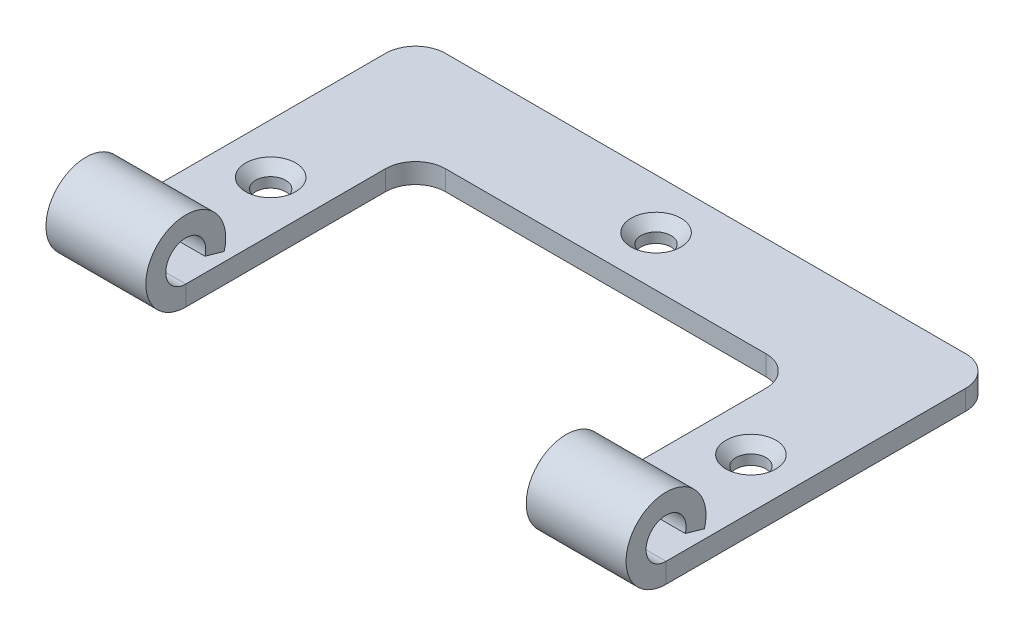
ISO-10303-21;
HEADER;
FILE_DESCRIPTION(('STEP AP214'),'2;1');
FILE_NAME('part.step','',(''),(''),'','','');
FILE_SCHEMA(('AUTOMOTIVE_DESIGN { 1 0 10303 214 1 1 1 1 }'));
ENDSEC;
DATA;
#1=APPLICATION_CONTEXT('core data for automotive mechanical design processes');
#2=APPLICATION_PROTOCOL_DEFINITION('international standard','automotive_design',2000,#1);
#3=PRODUCT_CONTEXT('',#1,'mechanical');
#4=PRODUCT('Part','Part','',(#3));
#5=PRODUCT_RELATED_PRODUCT_CATEGORY('part','',(#4));
#6=PRODUCT_DEFINITION_FORMATION('','',#4);
#7=PRODUCT_DEFINITION_CONTEXT('part definition',#1,'design');
#8=PRODUCT_DEFINITION('design','',#6,#7);
#9=PRODUCT_DEFINITION_SHAPE('','',#8);
#10=(LENGTH_UNIT() NAMED_UNIT(*) SI_UNIT(.MILLI.,.METRE.));
#11=(NAMED_UNIT(*) PLANE_ANGLE_UNIT() SI_UNIT($,.RADIAN.));
#12=(NAMED_UNIT(*) SI_UNIT($,.STERADIAN.) SOLID_ANGLE_UNIT());
#13=UNCERTAINTY_MEASURE_WITH_UNIT(LENGTH_MEASURE(1.E-05),#10,'distance_accuracy_value','');
#14=(GEOMETRIC_REPRESENTATION_CONTEXT(3) GLOBAL_UNCERTAINTY_ASSIGNED_CONTEXT((#13)) GLOBAL_UNIT_ASSIGNED_CONTEXT((#10,
#11,#12)) REPRESENTATION_CONTEXT('',''));
#15=CARTESIAN_POINT('',(0.,0.,0.));
#16=DIRECTION('',(0.,0.,1.));
#17=DIRECTION('',(1.,0.,0.));
#18=AXIS2_PLACEMENT_3D('',#15,#16,#17);
#19=CARTESIAN_POINT('',(19.,0.,6.46410161513776));
#20=DIRECTION('',(1.,0.,0.));
#21=DIRECTION('',(0.,0.,1.));
#22=AXIS2_PLACEMENT_3D('',#19,#20,#21);
#23=PLANE('',#22);
#24=DIRECTION('',(0.,-1.,0.));
#25=VECTOR('',#24,1.);
#26=CARTESIAN_POINT('',(19.,0.,16.5));
#27=LINE('',#26,#25);
#28=CARTESIAN_POINT('',(19.,2.,16.5));
#29=VERTEX_POINT('',#28);
#30=CARTESIAN_POINT('',(19.,0.,16.5));
#31=VERTEX_POINT('',#30);
#32=EDGE_CURVE('E110',#29,#31,#27,.T.);
#33=ORIENTED_EDGE('',*,*,#32,.F.);
#34=DIRECTION('',(0.,0.,-1.));
#35=VECTOR('',#34,1.);
#36=CARTESIAN_POINT('',(19.,2.,-3.5));
#37=LINE('',#36,#35);
#38=CARTESIAN_POINT('',(19.,2.,-3.49999999999998));
#39=VERTEX_POINT('',#38);
#40=EDGE_CURVE('E219',#39,#29,#37,.F.);
#41=ORIENTED_EDGE('',*,*,#40,.F.);
#42=DIRECTION('',(0.,-1.,0.));
#43=VECTOR('',#42,1.);
#44=CARTESIAN_POINT('',(19.,0.,-3.49999999999998));
#45=LINE('',#44,#43);
#46=CARTESIAN_POINT('',(19.,0.,-3.49999999999998));
#47=VERTEX_POINT('',#46);
#48=EDGE_CURVE('E101',#39,#47,#45,.T.);
#49=ORIENTED_EDGE('',*,*,#48,.T.);
#50=DIRECTION('',(0.,0.,1.));
#51=VECTOR('',#50,1.);
#52=CARTESIAN_POINT('',(19.,0.,6.46410161513776));
#53=LINE('',#52,#51);
#54=EDGE_CURVE('E648',#47,#31,#53,.T.);
#55=ORIENTED_EDGE('',*,*,#54,.T.);
#56=EDGE_LOOP('',(#33,#41,#49,#55));
#57=FACE_BOUND('',#56,.T.);
#58=ADVANCED_FACE('F40',(#57),#23,.F.);
#59=CARTESIAN_POINT('',(16.,0.,-3.5));
#60=DIRECTION('',(0.,-1.,0.));
#61=DIRECTION('',(0.,0.,-1.));
#62=AXIS2_PLACEMENT_3D('',#59,#60,#61);
#63=CYLINDRICAL_SURFACE('',#62,3.);
#64=ORIENTED_EDGE('',*,*,#48,.F.);
#65=CARTESIAN_POINT('',(16.,2.,-3.5));
#66=DIRECTION('',(0.,-1.,0.));
#67=DIRECTION('',(0.,0.,-1.));
#68=AXIS2_PLACEMENT_3D('',#65,#66,#67);
#69=CIRCLE('',#68,3.);
#70=CARTESIAN_POINT('',(16.,2.,-6.5));
#71=VERTEX_POINT('',#70);
#72=EDGE_CURVE('E217',#71,#39,#69,.T.);
#73=ORIENTED_EDGE('',*,*,#72,.F.);
#74=DIRECTION('',(0.,-1.,0.));
#75=VECTOR('',#74,1.);
#76=CARTESIAN_POINT('',(16.,0.,-6.5));
#77=LINE('',#76,#75);
#78=CARTESIAN_POINT('',(16.,0.,-6.5));
#79=VERTEX_POINT('',#78);
#80=EDGE_CURVE('E93',#71,#79,#77,.T.);
#81=ORIENTED_EDGE('',*,*,#80,.T.);
#82=CARTESIAN_POINT('',(16.,0.,-3.5));
#83=DIRECTION('',(0.,-1.,0.));
#84=DIRECTION('',(0.,0.,-1.));
#85=AXIS2_PLACEMENT_3D('',#82,#83,#84);
#86=CIRCLE('',#85,3.);
#87=EDGE_CURVE('E651',#79,#47,#86,.T.);
#88=ORIENTED_EDGE('',*,*,#87,.T.);
#89=EDGE_LOOP('',(#64,#73,#81,#88));
#90=FACE_BOUND('',#89,.T.);
#91=ADVANCED_FACE('F273',(#90),#63,.F.);
#92=CARTESIAN_POINT('',(-3.46410161513775,0.,-6.5));
#93=DIRECTION('',(0.,0.,-1.));
#94=DIRECTION('',(1.,0.,0.));
#95=AXIS2_PLACEMENT_3D('',#92,#93,#94);
#96=PLANE('',#95);
#97=ORIENTED_EDGE('',*,*,#80,.F.);
#98=DIRECTION('',(1.,0.,0.));
#99=VECTOR('',#98,1.);
#100=CARTESIAN_POINT('',(16.,2.,-6.5));
#101=LINE('',#100,#99);
#102=CARTESIAN_POINT('',(-16.0831471288754,2.,-6.5));
#103=VERTEX_POINT('',#102);
#104=EDGE_CURVE('E215',#103,#71,#101,.T.);
#105=ORIENTED_EDGE('',*,*,#104,.F.);
#106=DIRECTION('',(0.,-1.,0.));
#107=VECTOR('',#106,1.);
#108=CARTESIAN_POINT('',(-16.0831471288754,0.,-6.5));
#109=LINE('',#108,#107);
#110=CARTESIAN_POINT('',(-16.0831471288754,0.,-6.5));
#111=VERTEX_POINT('',#110);
#112=EDGE_CURVE('E235',#103,#111,#109,.T.);
#113=ORIENTED_EDGE('',*,*,#112,.T.);
#114=DIRECTION('',(1.,0.,0.));
#115=VECTOR('',#114,1.);
#116=CARTESIAN_POINT('',(-3.46410161513775,0.,-6.5));
#117=LINE('',#116,#115);
#118=EDGE_CURVE('E653',#111,#79,#117,.T.);
#119=ORIENTED_EDGE('',*,*,#118,.T.);
#120=EDGE_LOOP('',(#97,#105,#113,#119));
#121=FACE_BOUND('',#120,.T.);
#122=ADVANCED_FACE('F279',(#121),#96,.F.);
#123=CARTESIAN_POINT('',(-16.0831471288754,0.,-3.49999999999998));
#124=DIRECTION('',(0.,-1.,0.));
#125=DIRECTION('',(0.,0.,-1.));
#126=AXIS2_PLACEMENT_3D('',#123,#124,#125);
#127=CYLINDRICAL_SURFACE('',#126,3.00000000000002);
#128=ORIENTED_EDGE('',*,*,#112,.F.);
#129=CARTESIAN_POINT('',(-16.0831471288754,2.,-3.49999999999998));
#130=DIRECTION('',(0.,-1.,0.));
#131=DIRECTION('',(0.,0.,-1.));
#132=AXIS2_PLACEMENT_3D('',#129,#130,#131);
#133=CIRCLE('',#132,3.00000000000002);
#134=CARTESIAN_POINT('',(-19.0831471288754,2.,-3.49999999999998));
#135=VERTEX_POINT('',#134);
#136=EDGE_CURVE('E212',#135,#103,#133,.T.);
#137=ORIENTED_EDGE('',*,*,#136,.F.);
#138=DIRECTION('',(0.,-1.,0.));
#139=VECTOR('',#138,1.);
#140=CARTESIAN_POINT('',(-19.0831471288754,0.,-3.49999999999998));
#141=LINE('',#140,#139);
#142=CARTESIAN_POINT('',(-19.0831471288754,0.,-3.49999999999998));
#143=VERTEX_POINT('',#142);
#144=EDGE_CURVE('E233',#135,#143,#141,.T.);
#145=ORIENTED_EDGE('',*,*,#144,.T.);
#146=CARTESIAN_POINT('',(-16.0831471288754,0.,-3.49999999999998));
#147=DIRECTION('',(0.,-1.,0.));
#148=DIRECTION('',(0.,0.,1.));
#149=AXIS2_PLACEMENT_3D('',#146,#147,#148);
#150=CIRCLE('',#149,3.00000000000002);
#151=EDGE_CURVE('E655',#143,#111,#150,.T.);
#152=ORIENTED_EDGE('',*,*,#151,.T.);
#153=EDGE_LOOP('',(#128,#137,#145,#152));
#154=FACE_BOUND('',#153,.T.);
#155=ADVANCED_FACE('F332',(#154),#127,.F.);
#156=CARTESIAN_POINT('',(-19.0831471288754,0.,-3.49999999999998));
#157=DIRECTION('',(-1.,0.,0.));
#158=DIRECTION('',(0.,0.,-1.));
#159=AXIS2_PLACEMENT_3D('',#156,#157,#158);
#160=PLANE('',#159);
#161=ORIENTED_EDGE('',*,*,#144,.F.);
#162=DIRECTION('',(0.,0.,-1.));
#163=VECTOR('',#162,1.);
#164=CARTESIAN_POINT('',(-19.0831471288754,2.,-3.5));
#165=LINE('',#164,#163);
#166=CARTESIAN_POINT('',(-19.0831471288754,2.,16.5));
#167=VERTEX_POINT('',#166);
#168=EDGE_CURVE('E209',#167,#135,#165,.T.);
#169=ORIENTED_EDGE('',*,*,#168,.F.);
#170=DIRECTION('',(0.,-1.,0.));
#171=VECTOR('',#170,1.);
#172=CARTESIAN_POINT('',(-19.0831471288754,0.,16.5));
#173=LINE('',#172,#171);
#174=CARTESIAN_POINT('',(-19.0831471288754,0.,16.5));
#175=VERTEX_POINT('',#174);
#176=EDGE_CURVE('E230',#167,#175,#173,.T.);
#177=ORIENTED_EDGE('',*,*,#176,.T.);
#178=DIRECTION('',(0.,0.,-1.));
#179=VECTOR('',#178,1.);
#180=CARTESIAN_POINT('',(-19.0831471288754,0.,-3.49999999999998));
#181=LINE('',#180,#179);
#182=EDGE_CURVE('E658',#175,#143,#181,.T.);
#183=ORIENTED_EDGE('',*,*,#182,.T.);
#184=EDGE_LOOP('',(#161,#169,#177,#183));
#185=FACE_BOUND('',#184,.T.);
#186=ADVANCED_FACE('F328',(#185),#160,.F.);
#187=CARTESIAN_POINT('',(-29.0831471288754,0.,12.5));
#188=DIRECTION('',(1.,0.,0.));
#189=DIRECTION('',(0.,0.,1.));
#190=AXIS2_PLACEMENT_3D('',#187,#188,#189);
#191=PLANE('',#190);
#192=DIRECTION('',(0.,-1.,0.));
#193=VECTOR('',#192,1.);
#194=CARTESIAN_POINT('',(-29.0831471288754,0.,16.5));
#195=LINE('',#194,#193);
#196=CARTESIAN_POINT('',(-29.0831471288754,2.,16.5));
#197=VERTEX_POINT('',#196);
#198=CARTESIAN_POINT('',(-29.0831471288754,0.,16.5));
#199=VERTEX_POINT('',#198);
#200=EDGE_CURVE('E227',#197,#199,#195,.T.);
#201=ORIENTED_EDGE('',*,*,#200,.F.);
#202=DIRECTION('',(0.,0.,-1.));
#203=VECTOR('',#202,1.);
#204=CARTESIAN_POINT('',(-29.0831471288754,2.,-3.5));
#205=LINE('',#204,#203);
#206=CARTESIAN_POINT('',(-29.0831471288754,2.,-13.5));
#207=VERTEX_POINT('',#206);
#208=EDGE_CURVE('E204',#207,#197,#205,.F.);
#209=ORIENTED_EDGE('',*,*,#208,.F.);
#210=DIRECTION('',(0.,-1.,0.));
#211=VECTOR('',#210,1.);
#212=CARTESIAN_POINT('',(-29.0831471288754,0.,-13.5));
#213=LINE('',#212,#211);
#214=CARTESIAN_POINT('',(-29.0831471288754,0.,-13.5));
#215=VERTEX_POINT('',#214);
#216=EDGE_CURVE('E165',#207,#215,#213,.T.);
#217=ORIENTED_EDGE('',*,*,#216,.T.);
#218=DIRECTION('',(0.,0.,1.));
#219=VECTOR('',#218,1.);
#220=CARTESIAN_POINT('',(-29.0831471288754,0.,12.5));
#221=LINE('',#220,#219);
#222=EDGE_CURVE('E177',#215,#199,#221,.T.);
#223=ORIENTED_EDGE('',*,*,#222,.T.);
#224=EDGE_LOOP('',(#201,#209,#217,#223));
#225=FACE_BOUND('',#224,.T.);
#226=ADVANCED_FACE('F325',(#225),#191,.F.);
#227=CARTESIAN_POINT('',(-26.0831471288754,0.,-13.5));
#228=DIRECTION('',(0.,-1.,0.));
#229=DIRECTION('',(0.,0.,-1.));
#230=AXIS2_PLACEMENT_3D('',#227,#228,#229);
#231=CYLINDRICAL_SURFACE('',#230,3.);
#232=ORIENTED_EDGE('',*,*,#216,.F.);
#233=CARTESIAN_POINT('',(-26.0831471288754,2.,-13.5));
#234=DIRECTION('',(0.,1.,0.));
#235=DIRECTION('',(0.,0.,1.));
#236=AXIS2_PLACEMENT_3D('',#233,#234,#235);
#237=CIRCLE('',#236,3.);
#238=CARTESIAN_POINT('',(-26.0831471288755,2.,-16.5));
#239=VERTEX_POINT('',#238);
#240=EDGE_CURVE('E160',#239,#207,#237,.T.);
#241=ORIENTED_EDGE('',*,*,#240,.F.);
#242=DIRECTION('',(0.,-1.,0.));
#243=VECTOR('',#242,1.);
#244=CARTESIAN_POINT('',(-26.0831471288754,0.,-16.5));
#245=LINE('',#244,#243);
#246=CARTESIAN_POINT('',(-26.0831471288754,0.,-16.5));
#247=VERTEX_POINT('',#246);
#248=EDGE_CURVE('E155',#239,#247,#245,.T.);
#249=ORIENTED_EDGE('',*,*,#248,.T.);
#250=CARTESIAN_POINT('',(-26.0831471288754,0.,-13.5));
#251=DIRECTION('',(0.,1.,0.));
#252=DIRECTION('',(0.,0.,-1.));
#253=AXIS2_PLACEMENT_3D('',#250,#251,#252);
#254=CIRCLE('',#253,3.);
#255=EDGE_CURVE('E158',#247,#215,#254,.T.);
#256=ORIENTED_EDGE('',*,*,#255,.T.);
#257=EDGE_LOOP('',(#232,#241,#249,#256));
#258=FACE_BOUND('',#257,.T.);
#259=ADVANCED_FACE('F157',(#258),#231,.T.);
#260=CARTESIAN_POINT('',(-26.0831471288754,0.,-16.5));
#261=DIRECTION('',(0.,0.,1.));
#262=DIRECTION('',(-1.,0.,0.));
#263=AXIS2_PLACEMENT_3D('',#260,#261,#262);
#264=PLANE('',#263);
#265=ORIENTED_EDGE('',*,*,#248,.F.);
#266=DIRECTION('',(1.,0.,0.));
#267=VECTOR('',#266,1.);
#268=CARTESIAN_POINT('',(16.,2.,-16.5));
#269=LINE('',#268,#267);
#270=CARTESIAN_POINT('',(26.,2.,-16.5));
#271=VERTEX_POINT('',#270);
#272=EDGE_CURVE('E201',#271,#239,#269,.F.);
#273=ORIENTED_EDGE('',*,*,#272,.F.);
#274=DIRECTION('',(0.,-1.,0.));
#275=VECTOR('',#274,1.);
#276=CARTESIAN_POINT('',(26.,0.,-16.5));
#277=LINE('',#276,#275);
#278=CARTESIAN_POINT('',(26.,0.,-16.5));
#279=VERTEX_POINT('',#278);
#280=EDGE_CURVE('E166',#271,#279,#277,.T.);
#281=ORIENTED_EDGE('',*,*,#280,.T.);
#282=DIRECTION('',(-1.,0.,0.));
#283=VECTOR('',#282,1.);
#284=CARTESIAN_POINT('',(-26.0831471288754,0.,-16.5));
#285=LINE('',#284,#283);
#286=EDGE_CURVE('E175',#279,#247,#285,.T.);
#287=ORIENTED_EDGE('',*,*,#286,.T.);
#288=EDGE_LOOP('',(#265,#273,#281,#287));
#289=FACE_BOUND('',#288,.T.);
#290=ADVANCED_FACE('F179',(#289),#264,.F.);
#291=CARTESIAN_POINT('',(26.,0.,-13.5));
#292=DIRECTION('',(0.,-1.,0.));
#293=DIRECTION('',(0.,0.,-1.));
#294=AXIS2_PLACEMENT_3D('',#291,#292,#293);
#295=CYLINDRICAL_SURFACE('',#294,3.);
#296=ORIENTED_EDGE('',*,*,#280,.F.);
#297=CARTESIAN_POINT('',(26.,2.,-13.5));
#298=DIRECTION('',(0.,1.,0.));
#299=DIRECTION('',(0.,0.,1.));
#300=AXIS2_PLACEMENT_3D('',#297,#298,#299);
#301=CIRCLE('',#300,3.);
#302=CARTESIAN_POINT('',(29.,2.,-13.5));
#303=VERTEX_POINT('',#302);
#304=EDGE_CURVE('E197',#303,#271,#301,.T.);
#305=ORIENTED_EDGE('',*,*,#304,.F.);
#306=DIRECTION('',(0.,-1.,0.));
#307=VECTOR('',#306,1.);
#308=CARTESIAN_POINT('',(29.,0.,-13.5));
#309=LINE('',#308,#307);
#310=CARTESIAN_POINT('',(29.,0.,-13.5));
#311=VERTEX_POINT('',#310);
#312=EDGE_CURVE('E57',#303,#311,#309,.T.);
#313=ORIENTED_EDGE('',*,*,#312,.T.);
#314=CARTESIAN_POINT('',(26.,0.,-13.5));
#315=DIRECTION('',(0.,1.,0.));
#316=DIRECTION('',(0.,0.,-1.));
#317=AXIS2_PLACEMENT_3D('',#314,#315,#316);
#318=CIRCLE('',#317,3.);
#319=EDGE_CURVE('E180',#311,#279,#318,.T.);
#320=ORIENTED_EDGE('',*,*,#319,.T.);
#321=EDGE_LOOP('',(#296,#305,#313,#320));
#322=FACE_BOUND('',#321,.T.);
#323=ADVANCED_FACE('F317',(#322),#295,.T.);
#324=CARTESIAN_POINT('',(29.,0.,-13.5));
#325=DIRECTION('',(-1.,0.,0.));
#326=DIRECTION('',(0.,0.,-1.));
#327=AXIS2_PLACEMENT_3D('',#324,#325,#326);
#328=PLANE('',#327);
#329=ORIENTED_EDGE('',*,*,#312,.F.);
#330=DIRECTION('',(0.,0.,-1.));
#331=VECTOR('',#330,1.);
#332=CARTESIAN_POINT('',(29.,2.,-3.5));
#333=LINE('',#332,#331);
#334=CARTESIAN_POINT('',(29.,2.,16.5));
#335=VERTEX_POINT('',#334);
#336=EDGE_CURVE('E192',#335,#303,#333,.T.);
#337=ORIENTED_EDGE('',*,*,#336,.F.);
#338=DIRECTION('',(0.,-1.,0.));
#339=VECTOR('',#338,1.);
#340=CARTESIAN_POINT('',(29.,0.,16.5));
#341=LINE('',#340,#339);
#342=CARTESIAN_POINT('',(29.,0.,16.5));
#343=VERTEX_POINT('',#342);
#344=EDGE_CURVE('E191',#335,#343,#341,.T.);
#345=ORIENTED_EDGE('',*,*,#344,.T.);
#346=DIRECTION('',(0.,0.,-1.));
#347=VECTOR('',#346,1.);
#348=CARTESIAN_POINT('',(29.,0.,-13.5));
#349=LINE('',#348,#347);
#350=EDGE_CURVE('E643',#343,#311,#349,.T.);
#351=ORIENTED_EDGE('',*,*,#350,.T.);
#352=EDGE_LOOP('',(#329,#337,#345,#351));
#353=FACE_BOUND('',#352,.T.);
#354=ADVANCED_FACE('F313',(#353),#328,.F.);
#355=CARTESIAN_POINT('',(0.,0.,-11.5));
#356=DIRECTION('',(0.,-1.,0.));
#357=DIRECTION('',(0.,0.,-1.));
#358=AXIS2_PLACEMENT_3D('',#355,#356,#357);
#359=CYLINDRICAL_SURFACE('',#358,1.5);
#360=CARTESIAN_POINT('',(0.,1.,-11.5));
#361=DIRECTION('',(0.,-1.,0.));
#362=DIRECTION('',(0.,0.,-1.));
#363=AXIS2_PLACEMENT_3D('',#360,#361,#362);
#364=CIRCLE('',#363,1.5);
#365=CARTESIAN_POINT('',(0.,1.,-13.));
#366=VERTEX_POINT('',#365);
#367=EDGE_CURVE('E11',#366,#366,#364,.F.);
#368=ORIENTED_EDGE('',*,*,#367,.T.);
#369=EDGE_LOOP('',(#368));
#370=FACE_BOUND('',#369,.T.);
#371=CARTESIAN_POINT('',(0.,0.,-11.5));
#372=DIRECTION('',(0.,1.,0.));
#373=DIRECTION('',(0.,0.,1.));
#374=AXIS2_PLACEMENT_3D('',#371,#372,#373);
#375=CIRCLE('',#374,1.5);
#376=CARTESIAN_POINT('',(0.,0.,-10.));
#377=VERTEX_POINT('',#376);
#378=EDGE_CURVE('E200',#377,#377,#375,.T.);
#379=ORIENTED_EDGE('',*,*,#378,.F.);
#380=EDGE_LOOP('',(#379));
#381=FACE_BOUND('',#380,.T.);
#382=ADVANCED_FACE('F286',(#370,#381),#359,.F.);
#383=CARTESIAN_POINT('',(-24.0831471288754,0.,3.));
#384=DIRECTION('',(0.,-1.,0.));
#385=DIRECTION('',(0.,0.,-1.));
#386=AXIS2_PLACEMENT_3D('',#383,#384,#385);
#387=CYLINDRICAL_SURFACE('',#386,1.5);
#388=CARTESIAN_POINT('',(-24.0831471288754,1.00000000000001,3.));
#389=DIRECTION('',(0.,-1.,0.));
#390=DIRECTION('',(0.,0.,-1.));
#391=AXIS2_PLACEMENT_3D('',#388,#389,#390);
#392=CIRCLE('',#391,1.5);
#393=CARTESIAN_POINT('',(-24.0831471288754,1.00000000000001,1.5));
#394=VERTEX_POINT('',#393);
#395=EDGE_CURVE('E49',#394,#394,#392,.F.);
#396=ORIENTED_EDGE('',*,*,#395,.T.);
#397=EDGE_LOOP('',(#396));
#398=FACE_BOUND('',#397,.T.);
#399=CARTESIAN_POINT('',(-24.0831471288754,0.,3.));
#400=DIRECTION('',(0.,1.,0.));
#401=DIRECTION('',(0.,0.,1.));
#402=AXIS2_PLACEMENT_3D('',#399,#400,#401);
#403=CIRCLE('',#402,1.5);
#404=CARTESIAN_POINT('',(-24.0831471288754,0.,4.5));
#405=VERTEX_POINT('',#404);
#406=EDGE_CURVE('E182',#405,#405,#403,.T.);
#407=ORIENTED_EDGE('',*,*,#406,.F.);
#408=EDGE_LOOP('',(#407));
#409=FACE_BOUND('',#408,.T.);
#410=ADVANCED_FACE('F256',(#398,#409),#387,.F.);
#411=CARTESIAN_POINT('',(24.,0.,3.));
#412=DIRECTION('',(0.,-1.,0.));
#413=DIRECTION('',(0.,0.,-1.));
#414=AXIS2_PLACEMENT_3D('',#411,#412,#413);
#415=CYLINDRICAL_SURFACE('',#414,1.5);
#416=CARTESIAN_POINT('',(24.,1.00000000000001,3.));
#417=DIRECTION('',(0.,-1.,0.));
#418=DIRECTION('',(0.,0.,-1.));
#419=AXIS2_PLACEMENT_3D('',#416,#417,#418);
#420=CIRCLE('',#419,1.5);
#421=CARTESIAN_POINT('',(24.,1.00000000000001,1.5));
#422=VERTEX_POINT('',#421);
#423=EDGE_CURVE('E240',#422,#422,#420,.F.);
#424=ORIENTED_EDGE('',*,*,#423,.T.);
#425=EDGE_LOOP('',(#424));
#426=FACE_BOUND('',#425,.T.);
#427=CARTESIAN_POINT('',(24.,0.,3.));
#428=DIRECTION('',(0.,1.,0.));
#429=DIRECTION('',(0.,0.,1.));
#430=AXIS2_PLACEMENT_3D('',#427,#428,#429);
#431=CIRCLE('',#430,1.5);
#432=CARTESIAN_POINT('',(24.,0.,4.5));
#433=VERTEX_POINT('',#432);
#434=EDGE_CURVE('E188',#433,#433,#431,.T.);
#435=ORIENTED_EDGE('',*,*,#434,.F.);
#436=EDGE_LOOP('',(#435));
#437=FACE_BOUND('',#436,.T.);
#438=ADVANCED_FACE('F285',(#426,#437),#415,.F.);
#439=CARTESIAN_POINT('',(16.,0.,-3.5));
#440=DIRECTION('',(0.,-1.,0.));
#441=DIRECTION('',(0.,0.,-1.));
#442=AXIS2_PLACEMENT_3D('',#439,#440,#441);
#443=PLANE('',#442);
#444=ORIENTED_EDGE('',*,*,#378,.T.);
#445=EDGE_LOOP('',(#444));
#446=FACE_BOUND('',#445,.T.);
#447=ORIENTED_EDGE('',*,*,#350,.F.);
#448=DIRECTION('',(1.,0.,0.));
#449=VECTOR('',#448,1.);
#450=CARTESIAN_POINT('',(19.,0.,16.5));
#451=LINE('',#450,#449);
#452=EDGE_CURVE('E645',#31,#343,#451,.T.);
#453=ORIENTED_EDGE('',*,*,#452,.F.);
#454=ORIENTED_EDGE('',*,*,#54,.F.);
#455=ORIENTED_EDGE('',*,*,#87,.F.);
#456=ORIENTED_EDGE('',*,*,#118,.F.);
#457=ORIENTED_EDGE('',*,*,#151,.F.);
#458=ORIENTED_EDGE('',*,*,#182,.F.);
#459=DIRECTION('',(1.,0.,0.));
#460=VECTOR('',#459,1.);
#461=CARTESIAN_POINT('',(-29.0831471288754,0.,16.5));
#462=LINE('',#461,#460);
#463=EDGE_CURVE('E661',#199,#175,#462,.T.);
#464=ORIENTED_EDGE('',*,*,#463,.F.);
#465=ORIENTED_EDGE('',*,*,#222,.F.);
#466=ORIENTED_EDGE('',*,*,#255,.F.);
#467=ORIENTED_EDGE('',*,*,#286,.F.);
#468=ORIENTED_EDGE('',*,*,#319,.F.);
#469=EDGE_LOOP('',(#447,#453,#454,#455,#456,#457,#458,#464,#465,#466,#467,#468));
#470=FACE_BOUND('',#469,.T.);
#471=ORIENTED_EDGE('',*,*,#406,.T.);
#472=EDGE_LOOP('',(#471));
#473=FACE_BOUND('',#472,.T.);
#474=ORIENTED_EDGE('',*,*,#434,.T.);
#475=EDGE_LOOP('',(#474));
#476=FACE_BOUND('',#475,.T.);
#477=ADVANCED_FACE('F172',(#446,#470,#473,#476),#443,.T.);
#478=CARTESIAN_POINT('',(16.,2.,-3.5));
#479=DIRECTION('',(0.,-1.,0.));
#480=DIRECTION('',(0.,0.,-1.));
#481=AXIS2_PLACEMENT_3D('',#478,#479,#480);
#482=PLANE('',#481);
#483=CARTESIAN_POINT('',(24.,2.,3.));
#484=DIRECTION('',(0.,-1.,0.));
#485=DIRECTION('',(0.,0.,-1.));
#486=AXIS2_PLACEMENT_3D('',#483,#484,#485);
#487=CIRCLE('',#486,2.5);
#488=CARTESIAN_POINT('',(24.,2.,0.500000000000005));
#489=VERTEX_POINT('',#488);
#490=EDGE_CURVE('E251',#489,#489,#487,.T.);
#491=ORIENTED_EDGE('',*,*,#490,.T.);
#492=EDGE_LOOP('',(#491));
#493=FACE_BOUND('',#492,.T.);
#494=CARTESIAN_POINT('',(-24.0831471288754,2.,3.));
#495=DIRECTION('',(0.,-1.,0.));
#496=DIRECTION('',(0.,0.,-1.));
#497=AXIS2_PLACEMENT_3D('',#494,#495,#496);
#498=CIRCLE('',#497,2.5);
#499=CARTESIAN_POINT('',(-24.0831471288754,2.,0.500000000000009));
#500=VERTEX_POINT('',#499);
#501=EDGE_CURVE('E248',#500,#500,#498,.T.);
#502=ORIENTED_EDGE('',*,*,#501,.T.);
#503=EDGE_LOOP('',(#502));
#504=FACE_BOUND('',#503,.T.);
#505=CARTESIAN_POINT('',(0.,2.,-11.5));
#506=DIRECTION('',(0.,-1.,0.));
#507=DIRECTION('',(0.,0.,-1.));
#508=AXIS2_PLACEMENT_3D('',#505,#506,#507);
#509=CIRCLE('',#508,2.50000000000001);
#510=CARTESIAN_POINT('',(0.,2.,-14.));
#511=VERTEX_POINT('',#510);
#512=EDGE_CURVE('E245',#511,#511,#509,.T.);
#513=ORIENTED_EDGE('',*,*,#512,.T.);
#514=EDGE_LOOP('',(#513));
#515=FACE_BOUND('',#514,.T.);
#516=ORIENTED_EDGE('',*,*,#336,.T.);
#517=ORIENTED_EDGE('',*,*,#304,.T.);
#518=ORIENTED_EDGE('',*,*,#272,.T.);
#519=ORIENTED_EDGE('',*,*,#240,.T.);
#520=ORIENTED_EDGE('',*,*,#208,.T.);
#521=DIRECTION('',(1.,0.,0.));
#522=VECTOR('',#521,1.);
#523=CARTESIAN_POINT('',(16.,2.,16.5));
#524=LINE('',#523,#522);
#525=EDGE_CURVE('E207',#197,#167,#524,.T.);
#526=ORIENTED_EDGE('',*,*,#525,.T.);
#527=ORIENTED_EDGE('',*,*,#168,.T.);
#528=ORIENTED_EDGE('',*,*,#136,.T.);
#529=ORIENTED_EDGE('',*,*,#104,.T.);
#530=ORIENTED_EDGE('',*,*,#72,.T.);
#531=ORIENTED_EDGE('',*,*,#40,.T.);
#532=DIRECTION('',(1.,0.,0.));
#533=VECTOR('',#532,1.);
#534=CARTESIAN_POINT('',(16.,2.,16.5));
#535=LINE('',#534,#533);
#536=EDGE_CURVE('E195',#29,#335,#535,.T.);
#537=ORIENTED_EDGE('',*,*,#536,.T.);
#538=EDGE_LOOP('',(#516,#517,#518,#519,#520,#526,#527,#528,#529,#530,#531,#537));
#539=FACE_BOUND('',#538,.T.);
#540=ADVANCED_FACE('F292',(#493,#504,#515,#539),#482,.F.);
#541=CARTESIAN_POINT('',(24.,3.44872528836598,14.5774766081234));
#542=DIRECTION('',(0.,0.961261695938316,-0.275637355817009));
#543=DIRECTION('',(1.,0.,0.));
#544=AXIS2_PLACEMENT_3D('',#541,#542,#543);
#545=PLANE('',#544);
#546=DIRECTION('',(0.,-0.275637355817009,-0.961261695938316));
#547=VECTOR('',#546,1.);
#548=CARTESIAN_POINT('',(29.,3.44872528836598,14.5774766081234));
#549=LINE('',#548,#547);
#550=CARTESIAN_POINT('',(29.,3.44872528836598,14.5774766081234));
#551=VERTEX_POINT('',#550);
#552=CARTESIAN_POINT('',(29.,2.89745057673196,12.6549532162467));
#553=VERTEX_POINT('',#552);
#554=EDGE_CURVE('E196',#551,#553,#549,.T.);
#555=ORIENTED_EDGE('',*,*,#554,.F.);
#556=DIRECTION('',(1.,0.,0.));
#557=VECTOR('',#556,1.);
#558=CARTESIAN_POINT('',(29.,3.44872528836598,14.5774766081234));
#559=LINE('',#558,#557);
#560=CARTESIAN_POINT('',(19.,3.44872528836598,14.5774766081234));
#561=VERTEX_POINT('',#560);
#562=EDGE_CURVE('E623',#561,#551,#559,.T.);
#563=ORIENTED_EDGE('',*,*,#562,.F.);
#564=DIRECTION('',(0.,-0.275637355817009,-0.961261695938316));
#565=VECTOR('',#564,1.);
#566=CARTESIAN_POINT('',(19.,3.44872528836598,14.5774766081234));
#567=LINE('',#566,#565);
#568=CARTESIAN_POINT('',(19.,2.89745057673196,12.6549532162467));
#569=VERTEX_POINT('',#568);
#570=EDGE_CURVE('E629',#561,#569,#567,.T.);
#571=ORIENTED_EDGE('',*,*,#570,.T.);
#572=DIRECTION('',(1.,0.,0.));
#573=VECTOR('',#572,1.);
#574=CARTESIAN_POINT('',(29.,2.89745057673196,12.6549532162467));
#575=LINE('',#574,#573);
#576=EDGE_CURVE('E626',#569,#553,#575,.T.);
#577=ORIENTED_EDGE('',*,*,#576,.T.);
#578=EDGE_LOOP('',(#555,#563,#571,#577));
#579=FACE_BOUND('',#578,.T.);
#580=ADVANCED_FACE('F303',(#579),#545,.F.);
#581=CARTESIAN_POINT('',(19.,4.,16.5));
#582=DIRECTION('',(-1.,0.,0.));
#583=DIRECTION('',(0.,0.,1.));
#584=AXIS2_PLACEMENT_3D('',#581,#582,#583);
#585=PLANE('',#584);
#586=ORIENTED_EDGE('',*,*,#570,.F.);
#587=CARTESIAN_POINT('',(19.,4.,16.5));
#588=DIRECTION('',(1.,0.,0.));
#589=DIRECTION('',(0.,0.,-1.));
#590=AXIS2_PLACEMENT_3D('',#587,#588,#589);
#591=CIRCLE('',#590,2.);
#592=EDGE_CURVE('E633',#29,#561,#591,.F.);
#593=ORIENTED_EDGE('',*,*,#592,.F.);
#594=ORIENTED_EDGE('',*,*,#32,.T.);
#595=CARTESIAN_POINT('',(19.,4.,16.5));
#596=DIRECTION('',(1.,0.,0.));
#597=DIRECTION('',(0.,0.,-1.));
#598=AXIS2_PLACEMENT_3D('',#595,#596,#597);
#599=CIRCLE('',#598,4.);
#600=EDGE_CURVE('E640',#31,#569,#599,.F.);
#601=ORIENTED_EDGE('',*,*,#600,.T.);
#602=EDGE_LOOP('',(#586,#593,#594,#601));
#603=FACE_BOUND('',#602,.T.);
#604=ADVANCED_FACE('F472',(#603),#585,.T.);
#605=CARTESIAN_POINT('',(29.,4.,16.5));
#606=DIRECTION('',(-1.,0.,0.));
#607=DIRECTION('',(0.,0.,1.));
#608=AXIS2_PLACEMENT_3D('',#605,#606,#607);
#609=PLANE('',#608);
#610=CARTESIAN_POINT('',(29.,4.,16.5));
#611=DIRECTION('',(1.,0.,0.));
#612=DIRECTION('',(0.,0.,-1.));
#613=AXIS2_PLACEMENT_3D('',#610,#611,#612);
#614=CIRCLE('',#613,2.);
#615=EDGE_CURVE('E632',#551,#335,#614,.T.);
#616=ORIENTED_EDGE('',*,*,#615,.F.);
#617=ORIENTED_EDGE('',*,*,#554,.T.);
#618=CARTESIAN_POINT('',(29.,4.,16.5));
#619=DIRECTION('',(1.,0.,0.));
#620=DIRECTION('',(0.,0.,-1.));
#621=AXIS2_PLACEMENT_3D('',#618,#619,#620);
#622=CIRCLE('',#621,4.);
#623=EDGE_CURVE('E695',#553,#343,#622,.T.);
#624=ORIENTED_EDGE('',*,*,#623,.T.);
#625=ORIENTED_EDGE('',*,*,#344,.F.);
#626=EDGE_LOOP('',(#616,#617,#624,#625));
#627=FACE_BOUND('',#626,.T.);
#628=ADVANCED_FACE('F308',(#627),#609,.F.);
#629=CARTESIAN_POINT('',(29.,4.,16.5));
#630=DIRECTION('',(1.,0.,0.));
#631=DIRECTION('',(0.,-0.275637355817009,-0.961261695938316));
#632=AXIS2_PLACEMENT_3D('',#629,#630,#631);
#633=CYLINDRICAL_SURFACE('',#632,4.);
#634=ORIENTED_EDGE('',*,*,#452,.T.);
#635=ORIENTED_EDGE('',*,*,#623,.F.);
#636=ORIENTED_EDGE('',*,*,#576,.F.);
#637=ORIENTED_EDGE('',*,*,#600,.F.);
#638=EDGE_LOOP('',(#634,#635,#636,#637));
#639=FACE_BOUND('',#638,.T.);
#640=ADVANCED_FACE('F457',(#639),#633,.T.);
#641=CARTESIAN_POINT('',(29.,4.,16.5));
#642=DIRECTION('',(1.,0.,0.));
#643=DIRECTION('',(0.,-0.275637355817009,-0.961261695938316));
#644=AXIS2_PLACEMENT_3D('',#641,#642,#643);
#645=CYLINDRICAL_SURFACE('',#644,2.);
#646=ORIENTED_EDGE('',*,*,#536,.F.);
#647=ORIENTED_EDGE('',*,*,#592,.T.);
#648=ORIENTED_EDGE('',*,*,#562,.T.);
#649=ORIENTED_EDGE('',*,*,#615,.T.);
#650=EDGE_LOOP('',(#646,#647,#648,#649));
#651=FACE_BOUND('',#650,.T.);
#652=ADVANCED_FACE('F449',(#651),#645,.F.);
#653=CARTESIAN_POINT('',(-24.0831471288754,3.44872528836598,14.5774766081234));
#654=DIRECTION('',(0.,0.961261695938316,-0.275637355817009));
#655=DIRECTION('',(1.,0.,0.));
#656=AXIS2_PLACEMENT_3D('',#653,#654,#655);
#657=PLANE('',#656);
#658=DIRECTION('',(0.,-0.275637355817009,-0.961261695938316));
#659=VECTOR('',#658,1.);
#660=CARTESIAN_POINT('',(-19.0831471288754,3.44872528836598,14.5774766081234));
#661=LINE('',#660,#659);
#662=CARTESIAN_POINT('',(-19.0831471288754,3.44872528836598,14.5774766081234));
#663=VERTEX_POINT('',#662);
#664=CARTESIAN_POINT('',(-19.0831471288754,2.89745057673196,12.6549532162467));
#665=VERTEX_POINT('',#664);
#666=EDGE_CURVE('E634',#663,#665,#661,.T.);
#667=ORIENTED_EDGE('',*,*,#666,.F.);
#668=DIRECTION('',(1.,0.,0.));
#669=VECTOR('',#668,1.);
#670=CARTESIAN_POINT('',(-19.0831471288754,3.44872528836598,14.5774766081234));
#671=LINE('',#670,#669);
#672=CARTESIAN_POINT('',(-29.0831471288754,3.44872528836598,14.5774766081234));
#673=VERTEX_POINT('',#672);
#674=EDGE_CURVE('E689',#673,#663,#671,.T.);
#675=ORIENTED_EDGE('',*,*,#674,.F.);
#676=DIRECTION('',(0.,-0.275637355817009,-0.961261695938316));
#677=VECTOR('',#676,1.);
#678=CARTESIAN_POINT('',(-29.0831471288754,3.44872528836598,14.5774766081234));
#679=LINE('',#678,#677);
#680=CARTESIAN_POINT('',(-29.0831471288754,2.89745057673196,12.6549532162467));
#681=VERTEX_POINT('',#680);
#682=EDGE_CURVE('E677',#673,#681,#679,.T.);
#683=ORIENTED_EDGE('',*,*,#682,.T.);
#684=DIRECTION('',(1.,0.,0.));
#685=VECTOR('',#684,1.);
#686=CARTESIAN_POINT('',(-19.0831471288754,2.89745057673196,12.6549532162467));
#687=LINE('',#686,#685);
#688=EDGE_CURVE('E676',#681,#665,#687,.T.);
#689=ORIENTED_EDGE('',*,*,#688,.T.);
#690=EDGE_LOOP('',(#667,#675,#683,#689));
#691=FACE_BOUND('',#690,.T.);
#692=ADVANCED_FACE('F441',(#691),#657,.F.);
#693=CARTESIAN_POINT('',(-29.0831471288754,4.,16.5));
#694=DIRECTION('',(-1.,0.,0.));
#695=DIRECTION('',(0.,0.,1.));
#696=AXIS2_PLACEMENT_3D('',#693,#694,#695);
#697=PLANE('',#696);
#698=ORIENTED_EDGE('',*,*,#682,.F.);
#699=CARTESIAN_POINT('',(-29.0831471288754,4.,16.5));
#700=DIRECTION('',(1.,0.,0.));
#701=DIRECTION('',(0.,0.,-1.));
#702=AXIS2_PLACEMENT_3D('',#699,#700,#701);
#703=CIRCLE('',#702,2.);
#704=EDGE_CURVE('E671',#197,#673,#703,.F.);
#705=ORIENTED_EDGE('',*,*,#704,.F.);
#706=ORIENTED_EDGE('',*,*,#200,.T.);
#707=CARTESIAN_POINT('',(-29.0831471288754,4.,16.5));
#708=DIRECTION('',(1.,0.,0.));
#709=DIRECTION('',(0.,0.,-1.));
#710=AXIS2_PLACEMENT_3D('',#707,#708,#709);
#711=CIRCLE('',#710,4.);
#712=EDGE_CURVE('E669',#199,#681,#711,.F.);
#713=ORIENTED_EDGE('',*,*,#712,.T.);
#714=EDGE_LOOP('',(#698,#705,#706,#713));
#715=FACE_BOUND('',#714,.T.);
#716=ADVANCED_FACE('F433',(#715),#697,.T.);
#717=CARTESIAN_POINT('',(-19.0831471288754,4.,16.5));
#718=DIRECTION('',(-1.,0.,0.));
#719=DIRECTION('',(0.,0.,1.));
#720=AXIS2_PLACEMENT_3D('',#717,#718,#719);
#721=PLANE('',#720);
#722=CARTESIAN_POINT('',(-19.0831471288754,4.,16.5));
#723=DIRECTION('',(1.,0.,0.));
#724=DIRECTION('',(0.,0.,-1.));
#725=AXIS2_PLACEMENT_3D('',#722,#723,#724);
#726=CIRCLE('',#725,2.);
#727=EDGE_CURVE('E686',#663,#167,#726,.T.);
#728=ORIENTED_EDGE('',*,*,#727,.F.);
#729=ORIENTED_EDGE('',*,*,#666,.T.);
#730=CARTESIAN_POINT('',(-19.0831471288754,4.,16.5));
#731=DIRECTION('',(1.,0.,0.));
#732=DIRECTION('',(0.,0.,-1.));
#733=AXIS2_PLACEMENT_3D('',#730,#731,#732);
#734=CIRCLE('',#733,4.);
#735=EDGE_CURVE('E678',#665,#175,#734,.T.);
#736=ORIENTED_EDGE('',*,*,#735,.T.);
#737=ORIENTED_EDGE('',*,*,#176,.F.);
#738=EDGE_LOOP('',(#728,#729,#736,#737));
#739=FACE_BOUND('',#738,.T.);
#740=ADVANCED_FACE('F425',(#739),#721,.F.);
#741=CARTESIAN_POINT('',(-19.0831471288754,4.,16.5));
#742=DIRECTION('',(1.,0.,0.));
#743=DIRECTION('',(0.,-0.275637355817009,-0.961261695938316));
#744=AXIS2_PLACEMENT_3D('',#741,#742,#743);
#745=CYLINDRICAL_SURFACE('',#744,4.);
#746=ORIENTED_EDGE('',*,*,#463,.T.);
#747=ORIENTED_EDGE('',*,*,#735,.F.);
#748=ORIENTED_EDGE('',*,*,#688,.F.);
#749=ORIENTED_EDGE('',*,*,#712,.F.);
#750=EDGE_LOOP('',(#746,#747,#748,#749));
#751=FACE_BOUND('',#750,.T.);
#752=ADVANCED_FACE('F418',(#751),#745,.T.);
#753=CARTESIAN_POINT('',(-19.0831471288754,4.,16.5));
#754=DIRECTION('',(1.,0.,0.));
#755=DIRECTION('',(0.,-0.275637355817009,-0.961261695938316));
#756=AXIS2_PLACEMENT_3D('',#753,#754,#755);
#757=CYLINDRICAL_SURFACE('',#756,2.);
#758=ORIENTED_EDGE('',*,*,#525,.F.);
#759=ORIENTED_EDGE('',*,*,#704,.T.);
#760=ORIENTED_EDGE('',*,*,#674,.T.);
#761=ORIENTED_EDGE('',*,*,#727,.T.);
#762=EDGE_LOOP('',(#758,#759,#760,#761));
#763=FACE_BOUND('',#762,.T.);
#764=ADVANCED_FACE('F268',(#763),#757,.F.);
#765=CARTESIAN_POINT('',(24.,1.00000000000001,3.));
#766=DIRECTION('',(0.,1.,0.));
#767=DIRECTION('',(0.,0.,1.));
#768=AXIS2_PLACEMENT_3D('',#765,#766,#767);
#769=CONICAL_SURFACE('',#768,1.5,0.785398163397449);
#770=ORIENTED_EDGE('',*,*,#490,.F.);
#771=EDGE_LOOP('',(#770));
#772=FACE_BOUND('',#771,.T.);
#773=ORIENTED_EDGE('',*,*,#423,.F.);
#774=EDGE_LOOP('',(#773));
#775=FACE_BOUND('',#774,.T.);
#776=ADVANCED_FACE('F261',(#772,#775),#769,.F.);
#777=CARTESIAN_POINT('',(-24.0831471288754,1.00000000000001,3.));
#778=DIRECTION('',(0.,1.,0.));
#779=DIRECTION('',(0.,0.,1.));
#780=AXIS2_PLACEMENT_3D('',#777,#778,#779);
#781=CONICAL_SURFACE('',#780,1.5,0.785398163397449);
#782=ORIENTED_EDGE('',*,*,#501,.F.);
#783=EDGE_LOOP('',(#782));
#784=FACE_BOUND('',#783,.T.);
#785=ORIENTED_EDGE('',*,*,#395,.F.);
#786=EDGE_LOOP('',(#785));
#787=FACE_BOUND('',#786,.T.);
#788=ADVANCED_FACE('F259',(#784,#787),#781,.F.);
#789=CARTESIAN_POINT('',(0.,1.,-11.5));
#790=DIRECTION('',(0.,1.,0.));
#791=DIRECTION('',(0.,0.,1.));
#792=AXIS2_PLACEMENT_3D('',#789,#790,#791);
#793=CONICAL_SURFACE('',#792,1.5,0.785398163397452);
#794=ORIENTED_EDGE('',*,*,#512,.F.);
#795=EDGE_LOOP('',(#794));
#796=FACE_BOUND('',#795,.T.);
#797=ORIENTED_EDGE('',*,*,#367,.F.);
#798=EDGE_LOOP('',(#797));
#799=FACE_BOUND('',#798,.T.);
#800=ADVANCED_FACE('F42',(#796,#799),#793,.F.);
#801=CLOSED_SHELL('',(#58,#91,#122,#155,#186,#226,#259,#290,#323,#354,#382,#410,#438,#477,#540,
#580,#604,#628,#640,#652,#692,#716,#740,#752,#764,#776,#788,#800));
#802=MANIFOLD_SOLID_BREP('B2',#801);
#803=ADVANCED_BREP_SHAPE_REPRESENTATION('',(#18,#802),#14);
#804=SHAPE_DEFINITION_REPRESENTATION(#9,#803);
ENDSEC;
END-ISO-10303-21;
